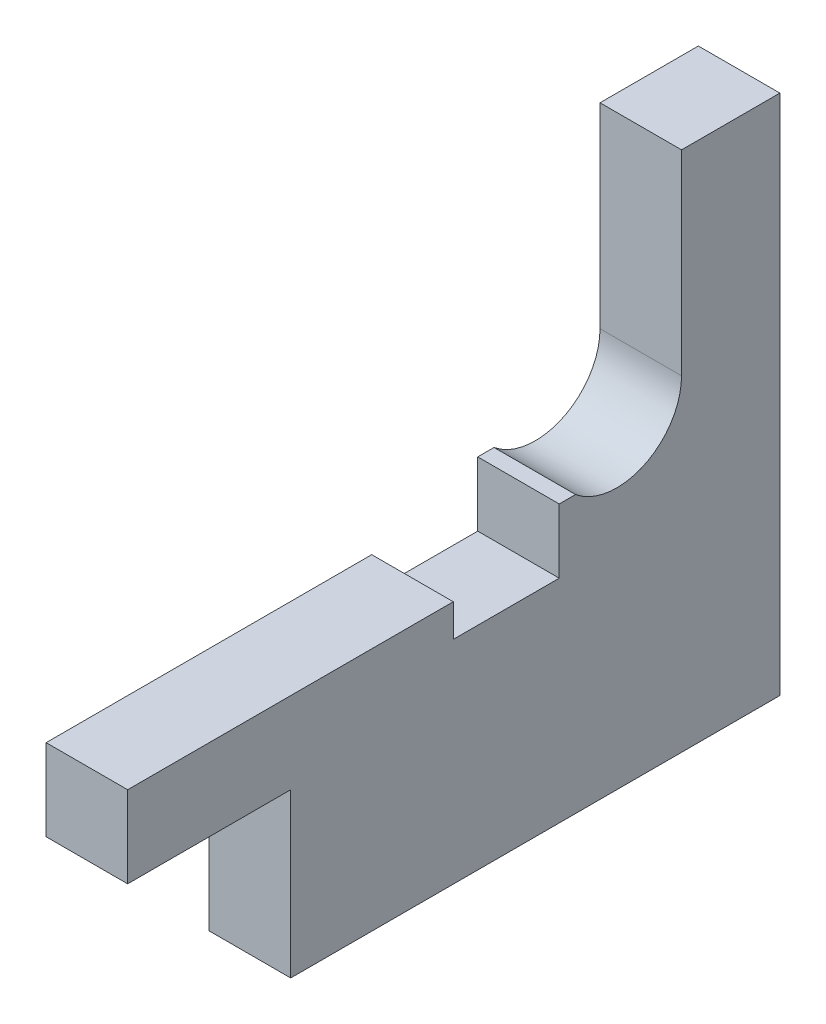
ISO-10303-21;
HEADER;
FILE_DESCRIPTION(('STEP AP214'),'2;1');
FILE_NAME('part.step','',(''),(''),'','','');
FILE_SCHEMA(('AUTOMOTIVE_DESIGN { 1 0 10303 214 1 1 1 1 }'));
ENDSEC;
DATA;
#1=APPLICATION_CONTEXT('core data for automotive mechanical design processes');
#2=APPLICATION_PROTOCOL_DEFINITION('international standard','automotive_design',2000,#1);
#3=PRODUCT_CONTEXT('',#1,'mechanical');
#4=PRODUCT('Part','Part','',(#3));
#5=PRODUCT_RELATED_PRODUCT_CATEGORY('part','',(#4));
#6=PRODUCT_DEFINITION_FORMATION('','',#4);
#7=PRODUCT_DEFINITION_CONTEXT('part definition',#1,'design');
#8=PRODUCT_DEFINITION('design','',#6,#7);
#9=PRODUCT_DEFINITION_SHAPE('','',#8);
#10=(LENGTH_UNIT() NAMED_UNIT(*) SI_UNIT(.MILLI.,.METRE.));
#11=(NAMED_UNIT(*) PLANE_ANGLE_UNIT() SI_UNIT($,.RADIAN.));
#12=(NAMED_UNIT(*) SI_UNIT($,.STERADIAN.) SOLID_ANGLE_UNIT());
#13=UNCERTAINTY_MEASURE_WITH_UNIT(LENGTH_MEASURE(1.E-05),#10,'distance_accuracy_value','');
#14=(GEOMETRIC_REPRESENTATION_CONTEXT(3) GLOBAL_UNCERTAINTY_ASSIGNED_CONTEXT((#13)) GLOBAL_UNIT_ASSIGNED_CONTEXT((#10,
#11,#12)) REPRESENTATION_CONTEXT('',''));
#15=CARTESIAN_POINT('',(0.,0.,0.));
#16=DIRECTION('',(0.,0.,1.));
#17=DIRECTION('',(1.,0.,0.));
#18=AXIS2_PLACEMENT_3D('',#15,#16,#17);
#19=CARTESIAN_POINT('',(5.,-3.05675481515937,3.53125));
#20=DIRECTION('',(0.,1.,0.));
#21=DIRECTION('',(0.,0.,1.));
#22=AXIS2_PLACEMENT_3D('',#19,#20,#21);
#23=PLANE('',#22);
#24=DIRECTION('',(0.,0.,-1.));
#25=VECTOR('',#24,1.);
#26=CARTESIAN_POINT('',(0.,-3.05675481515937,3.53125));
#27=LINE('',#26,#25);
#28=CARTESIAN_POINT('',(0.,-3.05675481515937,3.53125));
#29=VERTEX_POINT('',#28);
#30=CARTESIAN_POINT('',(0.,-3.05675481515937,2.53125));
#31=VERTEX_POINT('',#30);
#32=EDGE_CURVE('E178',#29,#31,#27,.T.);
#33=ORIENTED_EDGE('',*,*,#32,.F.);
#34=DIRECTION('',(-1.,0.,0.));
#35=VECTOR('',#34,1.);
#36=CARTESIAN_POINT('',(5.,-3.05675481515937,3.53125));
#37=LINE('',#36,#35);
#38=CARTESIAN_POINT('',(5.,-3.05675481515937,3.53125));
#39=VERTEX_POINT('',#38);
#40=EDGE_CURVE('E11',#39,#29,#37,.T.);
#41=ORIENTED_EDGE('',*,*,#40,.F.);
#42=DIRECTION('',(0.,0.,-1.));
#43=VECTOR('',#42,1.);
#44=CARTESIAN_POINT('',(5.,-3.05675481515937,3.53125));
#45=LINE('',#44,#43);
#46=CARTESIAN_POINT('',(5.,-3.05675481515937,2.53125));
#47=VERTEX_POINT('',#46);
#48=EDGE_CURVE('E226',#39,#47,#45,.T.);
#49=ORIENTED_EDGE('',*,*,#48,.T.);
#50=DIRECTION('',(-1.,0.,0.));
#51=VECTOR('',#50,1.);
#52=CARTESIAN_POINT('',(5.,-3.05675481515937,2.53125));
#53=LINE('',#52,#51);
#54=EDGE_CURVE('E48',#47,#31,#53,.T.);
#55=ORIENTED_EDGE('',*,*,#54,.T.);
#56=EDGE_LOOP('',(#33,#41,#49,#55));
#57=FACE_BOUND('',#56,.T.);
#58=ADVANCED_FACE('F45',(#57),#23,.T.);
#59=CARTESIAN_POINT('',(5.,-7.00000000000001,3.53125));
#60=DIRECTION('',(0.,0.,1.));
#61=DIRECTION('',(0.,-1.,0.));
#62=AXIS2_PLACEMENT_3D('',#59,#60,#61);
#63=PLANE('',#62);
#64=DIRECTION('',(0.,1.,0.));
#65=VECTOR('',#64,1.);
#66=CARTESIAN_POINT('',(0.,-7.00000000000001,3.53125));
#67=LINE('',#66,#65);
#68=CARTESIAN_POINT('',(0.,-7.00000000000001,3.53125));
#69=VERTEX_POINT('',#68);
#70=EDGE_CURVE('E223',#69,#29,#67,.T.);
#71=ORIENTED_EDGE('',*,*,#70,.F.);
#72=DIRECTION('',(-1.,0.,0.));
#73=VECTOR('',#72,1.);
#74=CARTESIAN_POINT('',(5.,-7.00000000000001,3.53125));
#75=LINE('',#74,#73);
#76=CARTESIAN_POINT('',(5.,-7.00000000000001,3.53125));
#77=VERTEX_POINT('',#76);
#78=EDGE_CURVE('E55',#77,#69,#75,.T.);
#79=ORIENTED_EDGE('',*,*,#78,.F.);
#80=DIRECTION('',(0.,1.,0.));
#81=VECTOR('',#80,1.);
#82=CARTESIAN_POINT('',(5.,-7.00000000000001,3.53125));
#83=LINE('',#82,#81);
#84=EDGE_CURVE('E164',#77,#39,#83,.T.);
#85=ORIENTED_EDGE('',*,*,#84,.T.);
#86=ORIENTED_EDGE('',*,*,#40,.T.);
#87=EDGE_LOOP('',(#71,#79,#85,#86));
#88=FACE_BOUND('',#87,.T.);
#89=ADVANCED_FACE('F259',(#88),#63,.T.);
#90=CARTESIAN_POINT('',(5.,-7.00000000000001,10.03125));
#91=DIRECTION('',(0.,1.,0.));
#92=DIRECTION('',(0.,0.,1.));
#93=AXIS2_PLACEMENT_3D('',#90,#91,#92);
#94=PLANE('',#93);
#95=DIRECTION('',(0.,0.,-1.));
#96=VECTOR('',#95,1.);
#97=CARTESIAN_POINT('',(0.,-7.00000000000001,10.03125));
#98=LINE('',#97,#96);
#99=CARTESIAN_POINT('',(0.,-7.00000000000001,10.03125));
#100=VERTEX_POINT('',#99);
#101=EDGE_CURVE('E150',#100,#69,#98,.T.);
#102=ORIENTED_EDGE('',*,*,#101,.F.);
#103=DIRECTION('',(-1.,0.,0.));
#104=VECTOR('',#103,1.);
#105=CARTESIAN_POINT('',(5.,-7.00000000000001,10.03125));
#106=LINE('',#105,#104);
#107=CARTESIAN_POINT('',(5.,-7.00000000000001,10.03125));
#108=VERTEX_POINT('',#107);
#109=EDGE_CURVE('E145',#108,#100,#106,.T.);
#110=ORIENTED_EDGE('',*,*,#109,.F.);
#111=DIRECTION('',(0.,0.,-1.));
#112=VECTOR('',#111,1.);
#113=CARTESIAN_POINT('',(5.,-7.00000000000001,10.03125));
#114=LINE('',#113,#112);
#115=EDGE_CURVE('E148',#108,#77,#114,.T.);
#116=ORIENTED_EDGE('',*,*,#115,.T.);
#117=ORIENTED_EDGE('',*,*,#78,.T.);
#118=EDGE_LOOP('',(#102,#110,#116,#117));
#119=FACE_BOUND('',#118,.T.);
#120=ADVANCED_FACE('F147',(#119),#94,.T.);
#121=CARTESIAN_POINT('',(5.,-5.00000000000001,10.03125));
#122=DIRECTION('',(0.,0.,-1.));
#123=DIRECTION('',(-1.,0.,0.));
#124=AXIS2_PLACEMENT_3D('',#121,#122,#123);
#125=PLANE('',#124);
#126=DIRECTION('',(0.,-1.,0.));
#127=VECTOR('',#126,1.);
#128=CARTESIAN_POINT('',(0.,-5.00000000000001,10.03125));
#129=LINE('',#128,#127);
#130=CARTESIAN_POINT('',(0.,-5.00000000000001,10.03125));
#131=VERTEX_POINT('',#130);
#132=EDGE_CURVE('E218',#131,#100,#129,.T.);
#133=ORIENTED_EDGE('',*,*,#132,.F.);
#134=DIRECTION('',(-1.,0.,0.));
#135=VECTOR('',#134,1.);
#136=CARTESIAN_POINT('',(5.,-5.00000000000001,10.03125));
#137=LINE('',#136,#135);
#138=CARTESIAN_POINT('',(5.,-5.00000000000001,10.03125));
#139=VERTEX_POINT('',#138);
#140=EDGE_CURVE('E156',#139,#131,#137,.T.);
#141=ORIENTED_EDGE('',*,*,#140,.F.);
#142=DIRECTION('',(0.,-1.,0.));
#143=VECTOR('',#142,1.);
#144=CARTESIAN_POINT('',(5.,-5.00000000000001,10.03125));
#145=LINE('',#144,#143);
#146=EDGE_CURVE('E162',#139,#108,#145,.T.);
#147=ORIENTED_EDGE('',*,*,#146,.T.);
#148=ORIENTED_EDGE('',*,*,#109,.T.);
#149=EDGE_LOOP('',(#133,#141,#147,#148));
#150=FACE_BOUND('',#149,.T.);
#151=ADVANCED_FACE('F167',(#150),#125,.T.);
#152=CARTESIAN_POINT('',(5.,-5.,30.));
#153=DIRECTION('',(0.,1.,0.));
#154=DIRECTION('',(0.,0.,1.));
#155=AXIS2_PLACEMENT_3D('',#152,#153,#154);
#156=PLANE('',#155);
#157=DIRECTION('',(0.,0.,-1.));
#158=VECTOR('',#157,1.);
#159=CARTESIAN_POINT('',(0.,-5.,30.));
#160=LINE('',#159,#158);
#161=CARTESIAN_POINT('',(0.,-5.,30.));
#162=VERTEX_POINT('',#161);
#163=EDGE_CURVE('E214',#162,#131,#160,.T.);
#164=ORIENTED_EDGE('',*,*,#163,.F.);
#165=DIRECTION('',(-1.,0.,0.));
#166=VECTOR('',#165,1.);
#167=CARTESIAN_POINT('',(5.,-5.,30.));
#168=LINE('',#167,#166);
#169=CARTESIAN_POINT('',(5.,-5.,30.));
#170=VERTEX_POINT('',#169);
#171=EDGE_CURVE('E232',#170,#162,#168,.T.);
#172=ORIENTED_EDGE('',*,*,#171,.F.);
#173=DIRECTION('',(0.,0.,-1.));
#174=VECTOR('',#173,1.);
#175=CARTESIAN_POINT('',(5.,-5.,30.));
#176=LINE('',#175,#174);
#177=EDGE_CURVE('E169',#170,#139,#176,.T.);
#178=ORIENTED_EDGE('',*,*,#177,.T.);
#179=ORIENTED_EDGE('',*,*,#140,.T.);
#180=EDGE_LOOP('',(#164,#172,#178,#179));
#181=FACE_BOUND('',#180,.T.);
#182=ADVANCED_FACE('F272',(#181),#156,.T.);
#183=CARTESIAN_POINT('',(5.,-10.,30.));
#184=DIRECTION('',(0.,0.,1.));
#185=DIRECTION('',(1.,0.,0.));
#186=AXIS2_PLACEMENT_3D('',#183,#184,#185);
#187=PLANE('',#186);
#188=DIRECTION('',(0.,1.,0.));
#189=VECTOR('',#188,1.);
#190=CARTESIAN_POINT('',(0.,-10.,30.));
#191=LINE('',#190,#189);
#192=CARTESIAN_POINT('',(0.,-10.,30.));
#193=VERTEX_POINT('',#192);
#194=EDGE_CURVE('E210',#193,#162,#191,.T.);
#195=ORIENTED_EDGE('',*,*,#194,.F.);
#196=DIRECTION('',(-1.,0.,0.));
#197=VECTOR('',#196,1.);
#198=CARTESIAN_POINT('',(5.,-10.,30.));
#199=LINE('',#198,#197);
#200=CARTESIAN_POINT('',(5.,-10.,30.));
#201=VERTEX_POINT('',#200);
#202=EDGE_CURVE('E235',#201,#193,#199,.T.);
#203=ORIENTED_EDGE('',*,*,#202,.F.);
#204=DIRECTION('',(0.,1.,0.));
#205=VECTOR('',#204,1.);
#206=CARTESIAN_POINT('',(5.,-10.,30.));
#207=LINE('',#206,#205);
#208=EDGE_CURVE('E172',#201,#170,#207,.T.);
#209=ORIENTED_EDGE('',*,*,#208,.T.);
#210=ORIENTED_EDGE('',*,*,#171,.T.);
#211=EDGE_LOOP('',(#195,#203,#209,#210));
#212=FACE_BOUND('',#211,.T.);
#213=ADVANCED_FACE('F275',(#212),#187,.T.);
#214=CARTESIAN_POINT('',(5.,-10.,20.));
#215=DIRECTION('',(0.,-1.,0.));
#216=DIRECTION('',(0.,0.,-1.));
#217=AXIS2_PLACEMENT_3D('',#214,#215,#216);
#218=PLANE('',#217);
#219=DIRECTION('',(0.,0.,1.));
#220=VECTOR('',#219,1.);
#221=CARTESIAN_POINT('',(0.,-10.,20.));
#222=LINE('',#221,#220);
#223=CARTESIAN_POINT('',(0.,-10.,20.));
#224=VERTEX_POINT('',#223);
#225=EDGE_CURVE('E206',#224,#193,#222,.T.);
#226=ORIENTED_EDGE('',*,*,#225,.F.);
#227=DIRECTION('',(-1.,0.,0.));
#228=VECTOR('',#227,1.);
#229=CARTESIAN_POINT('',(5.,-10.,20.));
#230=LINE('',#229,#228);
#231=CARTESIAN_POINT('',(5.,-10.,20.));
#232=VERTEX_POINT('',#231);
#233=EDGE_CURVE('E238',#232,#224,#230,.T.);
#234=ORIENTED_EDGE('',*,*,#233,.F.);
#235=DIRECTION('',(0.,0.,1.));
#236=VECTOR('',#235,1.);
#237=CARTESIAN_POINT('',(5.,-10.,20.));
#238=LINE('',#237,#236);
#239=EDGE_CURVE('E415',#232,#201,#238,.T.);
#240=ORIENTED_EDGE('',*,*,#239,.T.);
#241=ORIENTED_EDGE('',*,*,#202,.T.);
#242=EDGE_LOOP('',(#226,#234,#240,#241));
#243=FACE_BOUND('',#242,.T.);
#244=ADVANCED_FACE('F279',(#243),#218,.T.);
#245=CARTESIAN_POINT('',(5.,-20.,20.));
#246=DIRECTION('',(0.,0.,1.));
#247=DIRECTION('',(0.,-1.,0.));
#248=AXIS2_PLACEMENT_3D('',#245,#246,#247);
#249=PLANE('',#248);
#250=DIRECTION('',(0.,1.,0.));
#251=VECTOR('',#250,1.);
#252=CARTESIAN_POINT('',(0.,-20.,20.));
#253=LINE('',#252,#251);
#254=CARTESIAN_POINT('',(0.,-20.,20.));
#255=VERTEX_POINT('',#254);
#256=EDGE_CURVE('E202',#255,#224,#253,.T.);
#257=ORIENTED_EDGE('',*,*,#256,.F.);
#258=DIRECTION('',(-1.,0.,0.));
#259=VECTOR('',#258,1.);
#260=CARTESIAN_POINT('',(5.,-20.,20.));
#261=LINE('',#260,#259);
#262=CARTESIAN_POINT('',(5.,-20.,20.));
#263=VERTEX_POINT('',#262);
#264=EDGE_CURVE('E241',#263,#255,#261,.T.);
#265=ORIENTED_EDGE('',*,*,#264,.F.);
#266=DIRECTION('',(0.,1.,0.));
#267=VECTOR('',#266,1.);
#268=CARTESIAN_POINT('',(5.,-20.,20.));
#269=LINE('',#268,#267);
#270=EDGE_CURVE('E411',#263,#232,#269,.T.);
#271=ORIENTED_EDGE('',*,*,#270,.T.);
#272=ORIENTED_EDGE('',*,*,#233,.T.);
#273=EDGE_LOOP('',(#257,#265,#271,#272));
#274=FACE_BOUND('',#273,.T.);
#275=ADVANCED_FACE('F283',(#274),#249,.T.);
#276=CARTESIAN_POINT('',(5.,-20.,-10.));
#277=DIRECTION('',(0.,-1.,0.));
#278=DIRECTION('',(0.,0.,-1.));
#279=AXIS2_PLACEMENT_3D('',#276,#277,#278);
#280=PLANE('',#279);
#281=DIRECTION('',(0.,0.,1.));
#282=VECTOR('',#281,1.);
#283=CARTESIAN_POINT('',(0.,-20.,-10.));
#284=LINE('',#283,#282);
#285=CARTESIAN_POINT('',(0.,-20.,-10.));
#286=VERTEX_POINT('',#285);
#287=EDGE_CURVE('E198',#286,#255,#284,.T.);
#288=ORIENTED_EDGE('',*,*,#287,.F.);
#289=DIRECTION('',(-1.,0.,0.));
#290=VECTOR('',#289,1.);
#291=CARTESIAN_POINT('',(5.,-20.,-10.));
#292=LINE('',#291,#290);
#293=CARTESIAN_POINT('',(5.,-20.,-10.));
#294=VERTEX_POINT('',#293);
#295=EDGE_CURVE('E244',#294,#286,#292,.T.);
#296=ORIENTED_EDGE('',*,*,#295,.F.);
#297=DIRECTION('',(0.,0.,1.));
#298=VECTOR('',#297,1.);
#299=CARTESIAN_POINT('',(5.,-20.,-10.));
#300=LINE('',#299,#298);
#301=EDGE_CURVE('E425',#294,#263,#300,.T.);
#302=ORIENTED_EDGE('',*,*,#301,.T.);
#303=ORIENTED_EDGE('',*,*,#264,.T.);
#304=EDGE_LOOP('',(#288,#296,#302,#303));
#305=FACE_BOUND('',#304,.T.);
#306=ADVANCED_FACE('F287',(#305),#280,.T.);
#307=CARTESIAN_POINT('',(5.,12.,-10.));
#308=DIRECTION('',(0.,0.,-1.));
#309=DIRECTION('',(0.,1.,0.));
#310=AXIS2_PLACEMENT_3D('',#307,#308,#309);
#311=PLANE('',#310);
#312=DIRECTION('',(0.,-1.,0.));
#313=VECTOR('',#312,1.);
#314=CARTESIAN_POINT('',(0.,12.,-10.));
#315=LINE('',#314,#313);
#316=CARTESIAN_POINT('',(0.,12.,-10.));
#317=VERTEX_POINT('',#316);
#318=EDGE_CURVE('E194',#317,#286,#315,.T.);
#319=ORIENTED_EDGE('',*,*,#318,.F.);
#320=DIRECTION('',(-1.,0.,0.));
#321=VECTOR('',#320,1.);
#322=CARTESIAN_POINT('',(5.,12.,-10.));
#323=LINE('',#322,#321);
#324=CARTESIAN_POINT('',(5.,12.,-10.));
#325=VERTEX_POINT('',#324);
#326=EDGE_CURVE('E247',#325,#317,#323,.T.);
#327=ORIENTED_EDGE('',*,*,#326,.F.);
#328=DIRECTION('',(0.,-1.,0.));
#329=VECTOR('',#328,1.);
#330=CARTESIAN_POINT('',(5.,12.,-10.));
#331=LINE('',#330,#329);
#332=EDGE_CURVE('E404',#325,#294,#331,.T.);
#333=ORIENTED_EDGE('',*,*,#332,.T.);
#334=ORIENTED_EDGE('',*,*,#295,.T.);
#335=EDGE_LOOP('',(#319,#327,#333,#334));
#336=FACE_BOUND('',#335,.T.);
#337=ADVANCED_FACE('F291',(#336),#311,.T.);
#338=CARTESIAN_POINT('',(5.,12.,-3.96875));
#339=DIRECTION('',(0.,1.,0.));
#340=DIRECTION('',(0.,0.,1.));
#341=AXIS2_PLACEMENT_3D('',#338,#339,#340);
#342=PLANE('',#341);
#343=DIRECTION('',(0.,0.,-1.));
#344=VECTOR('',#343,1.);
#345=CARTESIAN_POINT('',(0.,12.,-3.96875));
#346=LINE('',#345,#344);
#347=CARTESIAN_POINT('',(0.,12.,-3.96875));
#348=VERTEX_POINT('',#347);
#349=EDGE_CURVE('E190',#348,#317,#346,.T.);
#350=ORIENTED_EDGE('',*,*,#349,.F.);
#351=DIRECTION('',(-1.,0.,0.));
#352=VECTOR('',#351,1.);
#353=CARTESIAN_POINT('',(5.,12.,-3.96875));
#354=LINE('',#353,#352);
#355=CARTESIAN_POINT('',(5.,12.,-3.96875));
#356=VERTEX_POINT('',#355);
#357=EDGE_CURVE('E250',#356,#348,#354,.T.);
#358=ORIENTED_EDGE('',*,*,#357,.F.);
#359=DIRECTION('',(0.,0.,-1.));
#360=VECTOR('',#359,1.);
#361=CARTESIAN_POINT('',(5.,12.,-3.96875));
#362=LINE('',#361,#360);
#363=EDGE_CURVE('E400',#356,#325,#362,.T.);
#364=ORIENTED_EDGE('',*,*,#363,.T.);
#365=ORIENTED_EDGE('',*,*,#326,.T.);
#366=EDGE_LOOP('',(#350,#358,#364,#365));
#367=FACE_BOUND('',#366,.T.);
#368=ADVANCED_FACE('F295',(#367),#342,.T.);
#369=CARTESIAN_POINT('',(5.,0.,-3.96875));
#370=DIRECTION('',(0.,0.,1.));
#371=DIRECTION('',(1.,0.,0.));
#372=AXIS2_PLACEMENT_3D('',#369,#370,#371);
#373=PLANE('',#372);
#374=DIRECTION('',(0.,1.,0.));
#375=VECTOR('',#374,1.);
#376=CARTESIAN_POINT('',(0.,0.,-3.96875));
#377=LINE('',#376,#375);
#378=CARTESIAN_POINT('',(0.,0.,-3.96875));
#379=VERTEX_POINT('',#378);
#380=EDGE_CURVE('E186',#379,#348,#377,.T.);
#381=ORIENTED_EDGE('',*,*,#380,.F.);
#382=DIRECTION('',(-1.,0.,0.));
#383=VECTOR('',#382,1.);
#384=CARTESIAN_POINT('',(5.,0.,-3.96875));
#385=LINE('',#384,#383);
#386=CARTESIAN_POINT('',(5.,0.,-3.96875));
#387=VERTEX_POINT('',#386);
#388=EDGE_CURVE('E252',#387,#379,#385,.T.);
#389=ORIENTED_EDGE('',*,*,#388,.F.);
#390=DIRECTION('',(0.,1.,0.));
#391=VECTOR('',#390,1.);
#392=CARTESIAN_POINT('',(5.,0.,-3.96875));
#393=LINE('',#392,#391);
#394=EDGE_CURVE('E432',#387,#356,#393,.T.);
#395=ORIENTED_EDGE('',*,*,#394,.T.);
#396=ORIENTED_EDGE('',*,*,#357,.T.);
#397=EDGE_LOOP('',(#381,#389,#395,#396));
#398=FACE_BOUND('',#397,.T.);
#399=ADVANCED_FACE('F299',(#398),#373,.T.);
#400=CARTESIAN_POINT('',(5.,0.,0.));
#401=DIRECTION('',(-1.,0.,0.));
#402=DIRECTION('',(0.,0.,1.));
#403=AXIS2_PLACEMENT_3D('',#400,#401,#402);
#404=CYLINDRICAL_SURFACE('',#403,3.96875);
#405=CARTESIAN_POINT('',(0.,0.,0.));
#406=DIRECTION('',(1.,0.,0.));
#407=DIRECTION('',(0.,0.,-1.));
#408=AXIS2_PLACEMENT_3D('',#405,#406,#407);
#409=CIRCLE('',#408,3.96875);
#410=EDGE_CURVE('E182',#31,#379,#409,.T.);
#411=ORIENTED_EDGE('',*,*,#410,.F.);
#412=ORIENTED_EDGE('',*,*,#54,.F.);
#413=CARTESIAN_POINT('',(5.,0.,0.));
#414=DIRECTION('',(1.,0.,0.));
#415=DIRECTION('',(0.,0.,-1.));
#416=AXIS2_PLACEMENT_3D('',#413,#414,#415);
#417=CIRCLE('',#416,3.96875);
#418=EDGE_CURVE('E435',#47,#387,#417,.T.);
#419=ORIENTED_EDGE('',*,*,#418,.T.);
#420=ORIENTED_EDGE('',*,*,#388,.T.);
#421=EDGE_LOOP('',(#411,#412,#419,#420));
#422=FACE_BOUND('',#421,.T.);
#423=ADVANCED_FACE('F256',(#422),#404,.F.);
#424=CARTESIAN_POINT('',(5.,0.,0.));
#425=DIRECTION('',(1.,0.,0.));
#426=DIRECTION('',(0.,0.,-1.));
#427=AXIS2_PLACEMENT_3D('',#424,#425,#426);
#428=PLANE('',#427);
#429=ORIENTED_EDGE('',*,*,#48,.F.);
#430=ORIENTED_EDGE('',*,*,#84,.F.);
#431=ORIENTED_EDGE('',*,*,#115,.F.);
#432=ORIENTED_EDGE('',*,*,#146,.F.);
#433=ORIENTED_EDGE('',*,*,#177,.F.);
#434=ORIENTED_EDGE('',*,*,#208,.F.);
#435=ORIENTED_EDGE('',*,*,#239,.F.);
#436=ORIENTED_EDGE('',*,*,#270,.F.);
#437=ORIENTED_EDGE('',*,*,#301,.F.);
#438=ORIENTED_EDGE('',*,*,#332,.F.);
#439=ORIENTED_EDGE('',*,*,#363,.F.);
#440=ORIENTED_EDGE('',*,*,#394,.F.);
#441=ORIENTED_EDGE('',*,*,#418,.F.);
#442=EDGE_LOOP('',(#429,#430,#431,#432,#433,#434,#435,#436,#437,#438,#439,#440,#441));
#443=FACE_BOUND('',#442,.T.);
#444=ADVANCED_FACE('F160',(#443),#428,.T.);
#445=CARTESIAN_POINT('',(0.,0.,0.));
#446=DIRECTION('',(1.,0.,0.));
#447=DIRECTION('',(0.,0.,-1.));
#448=AXIS2_PLACEMENT_3D('',#445,#446,#447);
#449=PLANE('',#448);
#450=ORIENTED_EDGE('',*,*,#32,.T.);
#451=ORIENTED_EDGE('',*,*,#410,.T.);
#452=ORIENTED_EDGE('',*,*,#380,.T.);
#453=ORIENTED_EDGE('',*,*,#349,.T.);
#454=ORIENTED_EDGE('',*,*,#318,.T.);
#455=ORIENTED_EDGE('',*,*,#287,.T.);
#456=ORIENTED_EDGE('',*,*,#256,.T.);
#457=ORIENTED_EDGE('',*,*,#225,.T.);
#458=ORIENTED_EDGE('',*,*,#194,.T.);
#459=ORIENTED_EDGE('',*,*,#163,.T.);
#460=ORIENTED_EDGE('',*,*,#132,.T.);
#461=ORIENTED_EDGE('',*,*,#101,.T.);
#462=ORIENTED_EDGE('',*,*,#70,.T.);
#463=EDGE_LOOP('',(#450,#451,#452,#453,#454,#455,#456,#457,#458,#459,#460,#461,#462));
#464=FACE_BOUND('',#463,.T.);
#465=ADVANCED_FACE('F258',(#464),#449,.F.);
#466=CLOSED_SHELL('',(#58,#89,#120,#151,#182,#213,#244,#275,#306,#337,#368,#399,#423,#444,#465));
#467=MANIFOLD_SOLID_BREP('B2',#466);
#468=ADVANCED_BREP_SHAPE_REPRESENTATION('',(#18,#467),#14);
#469=SHAPE_DEFINITION_REPRESENTATION(#9,#468);
ENDSEC;
END-ISO-10303-21;
